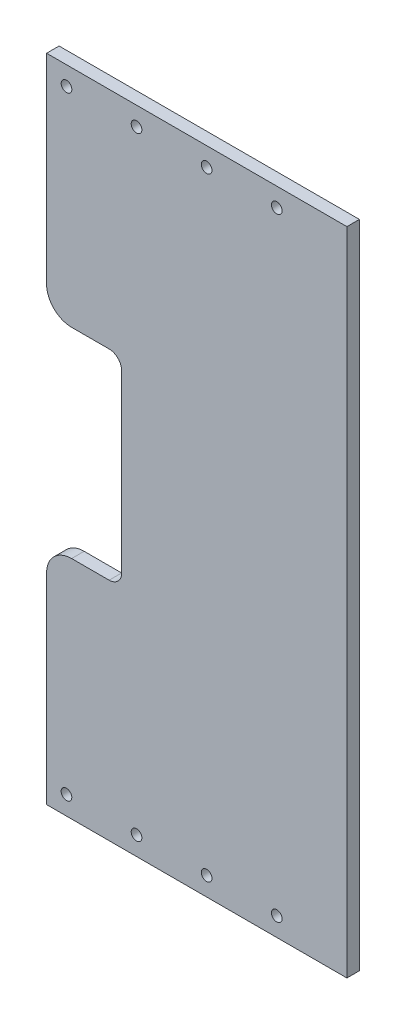
ISO-10303-21;
HEADER;
FILE_DESCRIPTION(('STEP AP214'),'2;1');
FILE_NAME('part.step','',(''),(''),'','','');
FILE_SCHEMA(('AUTOMOTIVE_DESIGN { 1 0 10303 214 1 1 1 1 }'));
ENDSEC;
DATA;
#1=APPLICATION_CONTEXT('core data for automotive mechanical design processes');
#2=APPLICATION_PROTOCOL_DEFINITION('international standard','automotive_design',2000,#1);
#3=PRODUCT_CONTEXT('',#1,'mechanical');
#4=PRODUCT('Part','Part','',(#3));
#5=PRODUCT_RELATED_PRODUCT_CATEGORY('part','',(#4));
#6=PRODUCT_DEFINITION_FORMATION('','',#4);
#7=PRODUCT_DEFINITION_CONTEXT('part definition',#1,'design');
#8=PRODUCT_DEFINITION('design','',#6,#7);
#9=PRODUCT_DEFINITION_SHAPE('','',#8);
#10=(LENGTH_UNIT() NAMED_UNIT(*) SI_UNIT(.MILLI.,.METRE.));
#11=(NAMED_UNIT(*) PLANE_ANGLE_UNIT() SI_UNIT($,.RADIAN.));
#12=(NAMED_UNIT(*) SI_UNIT($,.STERADIAN.) SOLID_ANGLE_UNIT());
#13=UNCERTAINTY_MEASURE_WITH_UNIT(LENGTH_MEASURE(1.E-05),#10,'distance_accuracy_value','');
#14=(GEOMETRIC_REPRESENTATION_CONTEXT(3) GLOBAL_UNCERTAINTY_ASSIGNED_CONTEXT((#13)) GLOBAL_UNIT_ASSIGNED_CONTEXT((#10,
#11,#12)) REPRESENTATION_CONTEXT('',''));
#15=CARTESIAN_POINT('',(0.,0.,0.));
#16=DIRECTION('',(0.,0.,1.));
#17=DIRECTION('',(1.,0.,0.));
#18=AXIS2_PLACEMENT_3D('',#15,#16,#17);
#19=CARTESIAN_POINT('',(-31.7482479630799,-31.6510369494426,3.175));
#20=DIRECTION('',(0.,0.,1.));
#21=DIRECTION('',(1.,0.,0.));
#22=AXIS2_PLACEMENT_3D('',#19,#20,#21);
#23=PLANE('',#22);
#24=CARTESIAN_POINT('',(-15.2749199243039,77.7875000000002,3.175));
#25=DIRECTION('',(0.,0.,1.));
#26=DIRECTION('',(1.,0.,0.));
#27=AXIS2_PLACEMENT_3D('',#24,#25,#26);
#28=CIRCLE('',#27,1.35255075153402);
#29=CARTESIAN_POINT('',(-13.9223691727699,77.7875000000002,3.175));
#30=VERTEX_POINT('',#29);
#31=EDGE_CURVE('E518',#30,#30,#28,.T.);
#32=ORIENTED_EDGE('',*,*,#31,.F.);
#33=EDGE_LOOP('',(#32));
#34=FACE_BOUND('',#33,.T.);
#35=CARTESIAN_POINT('',(20.2981426532958,77.7875000000002,3.175));
#36=DIRECTION('',(0.,0.,1.));
#37=DIRECTION('',(0.,-1.,0.));
#38=AXIS2_PLACEMENT_3D('',#35,#36,#37);
#39=ELLIPSE('',#38,1.35255000000001,1.35254924846639);
#40=CARTESIAN_POINT('',(20.2981426532958,76.4349500000001,3.175));
#41=VERTEX_POINT('',#40);
#42=EDGE_CURVE('E530',#41,#41,#39,.T.);
#43=ORIENTED_EDGE('',*,*,#42,.F.);
#44=EDGE_LOOP('',(#43));
#45=FACE_BOUND('',#44,.T.);
#46=CARTESIAN_POINT('',(-15.2747482365244,-77.7874999999998,3.175));
#47=DIRECTION('',(0.,0.,1.));
#48=DIRECTION('',(1.,0.,0.));
#49=AXIS2_PLACEMENT_3D('',#46,#47,#48);
#50=CIRCLE('',#49,1.35255075153402);
#51=CARTESIAN_POINT('',(-13.9221974849904,-77.7874999999998,3.175));
#52=VERTEX_POINT('',#51);
#53=EDGE_CURVE('E543',#52,#52,#50,.T.);
#54=ORIENTED_EDGE('',*,*,#53,.F.);
#55=EDGE_LOOP('',(#54));
#56=FACE_BOUND('',#55,.T.);
#57=CARTESIAN_POINT('',(20.2983143410756,-77.7874999999998,3.175));
#58=DIRECTION('',(0.,0.,1.));
#59=DIRECTION('',(0.,-1.,0.));
#60=AXIS2_PLACEMENT_3D('',#57,#58,#59);
#61=ELLIPSE('',#60,1.35255000000001,1.35254924846639);
#62=CARTESIAN_POINT('',(20.2983143410756,-79.1400499999998,3.175));
#63=VERTEX_POINT('',#62);
#64=EDGE_CURVE('E166',#63,#63,#61,.T.);
#65=ORIENTED_EDGE('',*,*,#64,.F.);
#66=EDGE_LOOP('',(#65));
#67=FACE_BOUND('',#66,.T.);
#68=DIRECTION('',(-1.,0.,0.));
#69=VECTOR('',#68,1.);
#70=CARTESIAN_POINT('',(-38.0982444347531,82.5499999999999,3.175));
#71=LINE('',#70,#69);
#72=CARTESIAN_POINT('',(38.0982444347532,82.5499999999999,3.175));
#73=VERTEX_POINT('',#72);
#74=CARTESIAN_POINT('',(-38.0982444347531,82.5499999999999,3.175));
#75=VERTEX_POINT('',#74);
#76=EDGE_CURVE('E185',#73,#75,#71,.T.);
#77=ORIENTED_EDGE('',*,*,#76,.T.);
#78=DIRECTION('',(0.,-1.,0.));
#79=VECTOR('',#78,1.);
#80=CARTESIAN_POINT('',(-38.0982444347531,82.5499999999999,3.175));
#81=LINE('',#80,#79);
#82=CARTESIAN_POINT('',(-38.0982444347531,31.8489630505574,3.175));
#83=VERTEX_POINT('',#82);
#84=EDGE_CURVE('E113',#75,#83,#81,.T.);
#85=ORIENTED_EDGE('',*,*,#84,.T.);
#86=CARTESIAN_POINT('',(-31.7482479630799,31.8489630505574,3.175));
#87=DIRECTION('',(0.,0.,1.));
#88=DIRECTION('',(-5.03665350895893E-11,-1.,0.));
#89=AXIS2_PLACEMENT_3D('',#86,#87,#88);
#90=ELLIPSE('',#89,6.34999999999999,6.3499964716732);
#91=CARTESIAN_POINT('',(-31.7482479630799,25.4989630505574,3.175));
#92=VERTEX_POINT('',#91);
#93=EDGE_CURVE('E212',#83,#92,#90,.T.);
#94=ORIENTED_EDGE('',*,*,#93,.T.);
#95=DIRECTION('',(1.,0.,0.));
#96=VECTOR('',#95,1.);
#97=CARTESIAN_POINT('',(-31.7482479630799,25.4989630505574,3.175));
#98=LINE('',#97,#96);
#99=CARTESIAN_POINT('',(-22.2232532555701,25.4989630505574,3.175));
#100=VERTEX_POINT('',#99);
#101=EDGE_CURVE('E231',#92,#100,#98,.T.);
#102=ORIENTED_EDGE('',*,*,#101,.T.);
#103=CARTESIAN_POINT('',(-22.2232532555701,22.3239630505574,3.175));
#104=DIRECTION('',(0.,0.,-1.));
#105=DIRECTION('',(5.03665350895893E-11,1.,0.));
#106=AXIS2_PLACEMENT_3D('',#103,#104,#105);
#107=ELLIPSE('',#106,3.175,3.1749982358366);
#108=CARTESIAN_POINT('',(-19.0482550197335,22.3239630505574,3.175));
#109=VERTEX_POINT('',#108);
#110=EDGE_CURVE('E228',#100,#109,#107,.T.);
#111=ORIENTED_EDGE('',*,*,#110,.T.);
#112=DIRECTION('',(0.,-1.,0.));
#113=VECTOR('',#112,1.);
#114=CARTESIAN_POINT('',(-19.0482550197335,22.3239630505574,3.175));
#115=LINE('',#114,#113);
#116=CARTESIAN_POINT('',(-19.0482550197335,-22.1260369494426,3.175));
#117=VERTEX_POINT('',#116);
#118=EDGE_CURVE('E230',#109,#117,#115,.T.);
#119=ORIENTED_EDGE('',*,*,#118,.T.);
#120=CARTESIAN_POINT('',(-22.2232532555701,-22.1260369494426,3.175));
#121=DIRECTION('',(0.,0.,-1.));
#122=DIRECTION('',(5.03665350895893E-11,1.,0.));
#123=AXIS2_PLACEMENT_3D('',#120,#121,#122);
#124=ELLIPSE('',#123,3.175,3.1749982358366);
#125=CARTESIAN_POINT('',(-22.2232532555701,-25.3010369494426,3.175));
#126=VERTEX_POINT('',#125);
#127=EDGE_CURVE('E233',#117,#126,#124,.T.);
#128=ORIENTED_EDGE('',*,*,#127,.T.);
#129=DIRECTION('',(-1.,0.,0.));
#130=VECTOR('',#129,1.);
#131=CARTESIAN_POINT('',(-22.2232532555701,-25.3010369494426,3.175));
#132=LINE('',#131,#130);
#133=CARTESIAN_POINT('',(-31.7482479630799,-25.3010369494426,3.175));
#134=VERTEX_POINT('',#133);
#135=EDGE_CURVE('E289',#126,#134,#132,.T.);
#136=ORIENTED_EDGE('',*,*,#135,.T.);
#137=CARTESIAN_POINT('',(-31.7482479630799,-31.6510369494426,3.175));
#138=DIRECTION('',(0.,0.,1.));
#139=DIRECTION('',(-5.03665350895893E-11,-1.,0.));
#140=AXIS2_PLACEMENT_3D('',#137,#138,#139);
#141=ELLIPSE('',#140,6.35,6.34999647167321);
#142=CARTESIAN_POINT('',(-38.0982444347531,-31.6510369494426,3.175));
#143=VERTEX_POINT('',#142);
#144=EDGE_CURVE('E144',#134,#143,#141,.T.);
#145=ORIENTED_EDGE('',*,*,#144,.T.);
#146=DIRECTION('',(0.,-1.,0.));
#147=VECTOR('',#146,1.);
#148=CARTESIAN_POINT('',(-38.0982444347531,-82.5500000000001,3.175));
#149=LINE('',#148,#147);
#150=CARTESIAN_POINT('',(-38.0982444347531,-82.5500000000001,3.175));
#151=VERTEX_POINT('',#150);
#152=EDGE_CURVE('E138',#143,#151,#149,.T.);
#153=ORIENTED_EDGE('',*,*,#152,.T.);
#154=DIRECTION('',(1.,0.,0.));
#155=VECTOR('',#154,1.);
#156=CARTESIAN_POINT('',(-38.0982444347531,-82.5500000000001,3.175));
#157=LINE('',#156,#155);
#158=CARTESIAN_POINT('',(38.0984161225328,-82.5500000000001,3.175));
#159=VERTEX_POINT('',#158);
#160=EDGE_CURVE('E142',#151,#159,#157,.T.);
#161=ORIENTED_EDGE('',*,*,#160,.T.);
#162=DIRECTION('',(-1.03990175445015E-06,0.999999999999459,0.));
#163=VECTOR('',#162,1.);
#164=CARTESIAN_POINT('',(38.0982444347532,82.5499999999999,3.175));
#165=LINE('',#164,#163);
#166=EDGE_CURVE('E58',#159,#73,#165,.T.);
#167=ORIENTED_EDGE('',*,*,#166,.T.);
#168=EDGE_LOOP('',(#77,#85,#94,#102,#111,#119,#128,#136,#145,#153,#161,#167));
#169=FACE_BOUND('',#168,.T.);
#170=CARTESIAN_POINT('',(2.50526164279612,-77.7874999999998,3.175));
#171=DIRECTION('',(0.,0.,1.));
#172=DIRECTION('',(1.,0.,0.));
#173=AXIS2_PLACEMENT_3D('',#170,#171,#172);
#174=CIRCLE('',#173,1.35255075153402);
#175=CARTESIAN_POINT('',(3.85781239433015,-77.7874999999998,3.175));
#176=VERTEX_POINT('',#175);
#177=EDGE_CURVE('E256',#176,#176,#174,.T.);
#178=ORIENTED_EDGE('',*,*,#177,.F.);
#179=EDGE_LOOP('',(#178));
#180=FACE_BOUND('',#179,.T.);
#181=CARTESIAN_POINT('',(-33.0547581158449,-77.7874999999998,3.175));
#182=DIRECTION('',(0.,0.,1.));
#183=DIRECTION('',(1.,0.,0.));
#184=AXIS2_PLACEMENT_3D('',#181,#182,#183);
#185=CIRCLE('',#184,1.35255075153402);
#186=CARTESIAN_POINT('',(-31.7022073643109,-77.7874999999998,3.175));
#187=VERTEX_POINT('',#186);
#188=EDGE_CURVE('E537',#187,#187,#185,.T.);
#189=ORIENTED_EDGE('',*,*,#188,.F.);
#190=EDGE_LOOP('',(#189));
#191=FACE_BOUND('',#190,.T.);
#192=CARTESIAN_POINT('',(2.5050899550166,77.7875000000002,3.175));
#193=DIRECTION('',(0.,0.,1.));
#194=DIRECTION('',(1.,0.,0.));
#195=AXIS2_PLACEMENT_3D('',#192,#193,#194);
#196=CIRCLE('',#195,1.35255075153402);
#197=CARTESIAN_POINT('',(3.85764070655063,77.7875000000002,3.175));
#198=VERTEX_POINT('',#197);
#199=EDGE_CURVE('E524',#198,#198,#196,.T.);
#200=ORIENTED_EDGE('',*,*,#199,.F.);
#201=EDGE_LOOP('',(#200));
#202=FACE_BOUND('',#201,.T.);
#203=CARTESIAN_POINT('',(-33.0418277087591,77.7875000000002,3.175));
#204=DIRECTION('',(0.,0.,1.));
#205=DIRECTION('',(0.,-1.,0.));
#206=AXIS2_PLACEMENT_3D('',#203,#204,#205);
#207=ELLIPSE('',#206,1.35255000000001,1.35254924846639);
#208=CARTESIAN_POINT('',(-33.0418277087591,76.4349500000001,3.175));
#209=VERTEX_POINT('',#208);
#210=EDGE_CURVE('E511',#209,#209,#207,.T.);
#211=ORIENTED_EDGE('',*,*,#210,.F.);
#212=EDGE_LOOP('',(#211));
#213=FACE_BOUND('',#212,.T.);
#214=ADVANCED_FACE('F41',(#34,#45,#56,#67,#169,#180,#191,#202,#213),#23,.T.);
#215=CARTESIAN_POINT('',(-31.7482479630799,-31.6510369494426,0.));
#216=DIRECTION('',(0.,0.,1.));
#217=DIRECTION('',(1.,0.,0.));
#218=AXIS2_PLACEMENT_3D('',#215,#216,#217);
#219=PLANE('',#218);
#220=DIRECTION('',(-1.,0.,0.));
#221=VECTOR('',#220,1.);
#222=CARTESIAN_POINT('',(-38.0982444347531,82.5499999999999,0.));
#223=LINE('',#222,#221);
#224=CARTESIAN_POINT('',(38.0982444347532,82.5499999999999,0.));
#225=VERTEX_POINT('',#224);
#226=CARTESIAN_POINT('',(-38.0982444347531,82.5499999999999,0.));
#227=VERTEX_POINT('',#226);
#228=EDGE_CURVE('E162',#225,#227,#223,.T.);
#229=ORIENTED_EDGE('',*,*,#228,.F.);
#230=DIRECTION('',(-1.03990175445015E-06,0.999999999999459,0.));
#231=VECTOR('',#230,1.);
#232=CARTESIAN_POINT('',(38.0982444347532,82.5499999999999,0.));
#233=LINE('',#232,#231);
#234=CARTESIAN_POINT('',(38.0984161225328,-82.5500000000001,0.));
#235=VERTEX_POINT('',#234);
#236=EDGE_CURVE('E105',#235,#225,#233,.T.);
#237=ORIENTED_EDGE('',*,*,#236,.F.);
#238=DIRECTION('',(1.,0.,0.));
#239=VECTOR('',#238,1.);
#240=CARTESIAN_POINT('',(-38.0982444347531,-82.5500000000001,0.));
#241=LINE('',#240,#239);
#242=CARTESIAN_POINT('',(-38.0982444347531,-82.5500000000001,0.));
#243=VERTEX_POINT('',#242);
#244=EDGE_CURVE('E99',#243,#235,#241,.T.);
#245=ORIENTED_EDGE('',*,*,#244,.F.);
#246=DIRECTION('',(0.,-1.,0.));
#247=VECTOR('',#246,1.);
#248=CARTESIAN_POINT('',(-38.0982444347531,-82.5500000000001,0.));
#249=LINE('',#248,#247);
#250=CARTESIAN_POINT('',(-38.0982444347531,-31.6510369494426,0.));
#251=VERTEX_POINT('',#250);
#252=EDGE_CURVE('E152',#251,#243,#249,.T.);
#253=ORIENTED_EDGE('',*,*,#252,.F.);
#254=CARTESIAN_POINT('',(-31.7482479630799,-31.6510369494426,0.));
#255=DIRECTION('',(0.,0.,1.));
#256=DIRECTION('',(-5.03665350895893E-11,-1.,0.));
#257=AXIS2_PLACEMENT_3D('',#254,#255,#256);
#258=ELLIPSE('',#257,6.35,6.34999647167321);
#259=CARTESIAN_POINT('',(-31.7482479630799,-25.3010369494426,0.));
#260=VERTEX_POINT('',#259);
#261=EDGE_CURVE('E180',#260,#251,#258,.T.);
#262=ORIENTED_EDGE('',*,*,#261,.F.);
#263=DIRECTION('',(-1.,0.,0.));
#264=VECTOR('',#263,1.);
#265=CARTESIAN_POINT('',(-22.2232532555701,-25.3010369494426,0.));
#266=LINE('',#265,#264);
#267=CARTESIAN_POINT('',(-22.2232532555701,-25.3010369494426,0.));
#268=VERTEX_POINT('',#267);
#269=EDGE_CURVE('E178',#268,#260,#266,.T.);
#270=ORIENTED_EDGE('',*,*,#269,.F.);
#271=CARTESIAN_POINT('',(-22.2232532555701,-22.1260369494426,0.));
#272=DIRECTION('',(0.,0.,-1.));
#273=DIRECTION('',(5.03665350895893E-11,1.,0.));
#274=AXIS2_PLACEMENT_3D('',#271,#272,#273);
#275=ELLIPSE('',#274,3.175,3.1749982358366);
#276=CARTESIAN_POINT('',(-19.0482550197335,-22.1260369494426,0.));
#277=VERTEX_POINT('',#276);
#278=EDGE_CURVE('E176',#277,#268,#275,.T.);
#279=ORIENTED_EDGE('',*,*,#278,.F.);
#280=DIRECTION('',(0.,-1.,0.));
#281=VECTOR('',#280,1.);
#282=CARTESIAN_POINT('',(-19.0482550197335,22.3239630505574,0.));
#283=LINE('',#282,#281);
#284=CARTESIAN_POINT('',(-19.0482550197335,22.3239630505574,0.));
#285=VERTEX_POINT('',#284);
#286=EDGE_CURVE('E174',#285,#277,#283,.T.);
#287=ORIENTED_EDGE('',*,*,#286,.F.);
#288=CARTESIAN_POINT('',(-22.2232532555701,22.3239630505574,0.));
#289=DIRECTION('',(0.,0.,-1.));
#290=DIRECTION('',(5.03665350895893E-11,1.,0.));
#291=AXIS2_PLACEMENT_3D('',#288,#289,#290);
#292=ELLIPSE('',#291,3.175,3.1749982358366);
#293=CARTESIAN_POINT('',(-22.2232532555701,25.4989630505574,0.));
#294=VERTEX_POINT('',#293);
#295=EDGE_CURVE('E172',#294,#285,#292,.T.);
#296=ORIENTED_EDGE('',*,*,#295,.F.);
#297=DIRECTION('',(1.,0.,0.));
#298=VECTOR('',#297,1.);
#299=CARTESIAN_POINT('',(-31.7482479630799,25.4989630505574,0.));
#300=LINE('',#299,#298);
#301=CARTESIAN_POINT('',(-31.7482479630799,25.4989630505574,0.));
#302=VERTEX_POINT('',#301);
#303=EDGE_CURVE('E170',#302,#294,#300,.T.);
#304=ORIENTED_EDGE('',*,*,#303,.F.);
#305=CARTESIAN_POINT('',(-31.7482479630799,31.8489630505574,0.));
#306=DIRECTION('',(0.,0.,1.));
#307=DIRECTION('',(-5.03665350895893E-11,-1.,0.));
#308=AXIS2_PLACEMENT_3D('',#305,#306,#307);
#309=ELLIPSE('',#308,6.34999999999999,6.3499964716732);
#310=CARTESIAN_POINT('',(-38.0982444347531,31.8489630505574,0.));
#311=VERTEX_POINT('',#310);
#312=EDGE_CURVE('E168',#311,#302,#309,.T.);
#313=ORIENTED_EDGE('',*,*,#312,.F.);
#314=DIRECTION('',(0.,-1.,0.));
#315=VECTOR('',#314,1.);
#316=CARTESIAN_POINT('',(-38.0982444347531,82.5499999999999,0.));
#317=LINE('',#316,#315);
#318=EDGE_CURVE('E165',#227,#311,#317,.T.);
#319=ORIENTED_EDGE('',*,*,#318,.F.);
#320=EDGE_LOOP('',(#229,#237,#245,#253,#262,#270,#279,#287,#296,#304,#313,#319));
#321=FACE_BOUND('',#320,.T.);
#322=CARTESIAN_POINT('',(20.2983143410756,-77.7874999999998,0.));
#323=DIRECTION('',(0.,0.,1.));
#324=DIRECTION('',(0.,-1.,0.));
#325=AXIS2_PLACEMENT_3D('',#322,#323,#324);
#326=ELLIPSE('',#325,1.35255000000001,1.35254924846639);
#327=CARTESIAN_POINT('',(20.2983143410756,-79.1400499999998,0.));
#328=VERTEX_POINT('',#327);
#329=EDGE_CURVE('E253',#328,#328,#326,.T.);
#330=ORIENTED_EDGE('',*,*,#329,.T.);
#331=EDGE_LOOP('',(#330));
#332=FACE_BOUND('',#331,.T.);
#333=CARTESIAN_POINT('',(2.50526164279612,-77.7874999999998,0.));
#334=DIRECTION('',(0.,0.,1.));
#335=DIRECTION('',(1.,0.,0.));
#336=AXIS2_PLACEMENT_3D('',#333,#334,#335);
#337=CIRCLE('',#336,1.35255075153402);
#338=CARTESIAN_POINT('',(3.85781239433015,-77.7874999999998,0.));
#339=VERTEX_POINT('',#338);
#340=EDGE_CURVE('E260',#339,#339,#337,.T.);
#341=ORIENTED_EDGE('',*,*,#340,.T.);
#342=EDGE_LOOP('',(#341));
#343=FACE_BOUND('',#342,.T.);
#344=CARTESIAN_POINT('',(-15.2747482365244,-77.7874999999998,0.));
#345=DIRECTION('',(0.,0.,1.));
#346=DIRECTION('',(1.,0.,0.));
#347=AXIS2_PLACEMENT_3D('',#344,#345,#346);
#348=CIRCLE('',#347,1.35255075153402);
#349=CARTESIAN_POINT('',(-13.9221974849904,-77.7874999999998,0.));
#350=VERTEX_POINT('',#349);
#351=EDGE_CURVE('E540',#350,#350,#348,.T.);
#352=ORIENTED_EDGE('',*,*,#351,.T.);
#353=EDGE_LOOP('',(#352));
#354=FACE_BOUND('',#353,.T.);
#355=CARTESIAN_POINT('',(-33.0547581158449,-77.7874999999998,0.));
#356=DIRECTION('',(0.,0.,1.));
#357=DIRECTION('',(1.,0.,0.));
#358=AXIS2_PLACEMENT_3D('',#355,#356,#357);
#359=CIRCLE('',#358,1.35255075153402);
#360=CARTESIAN_POINT('',(-31.7022073643109,-77.7874999999998,0.));
#361=VERTEX_POINT('',#360);
#362=EDGE_CURVE('E534',#361,#361,#359,.T.);
#363=ORIENTED_EDGE('',*,*,#362,.T.);
#364=EDGE_LOOP('',(#363));
#365=FACE_BOUND('',#364,.T.);
#366=CARTESIAN_POINT('',(20.2981426532958,77.7875000000002,0.));
#367=DIRECTION('',(0.,0.,1.));
#368=DIRECTION('',(0.,-1.,0.));
#369=AXIS2_PLACEMENT_3D('',#366,#367,#368);
#370=ELLIPSE('',#369,1.35255000000001,1.35254924846639);
#371=CARTESIAN_POINT('',(20.2981426532958,76.4349500000001,0.));
#372=VERTEX_POINT('',#371);
#373=EDGE_CURVE('E527',#372,#372,#370,.T.);
#374=ORIENTED_EDGE('',*,*,#373,.T.);
#375=EDGE_LOOP('',(#374));
#376=FACE_BOUND('',#375,.T.);
#377=CARTESIAN_POINT('',(2.5050899550166,77.7875000000002,0.));
#378=DIRECTION('',(0.,0.,1.));
#379=DIRECTION('',(1.,0.,0.));
#380=AXIS2_PLACEMENT_3D('',#377,#378,#379);
#381=CIRCLE('',#380,1.35255075153402);
#382=CARTESIAN_POINT('',(3.85764070655063,77.7875000000002,0.));
#383=VERTEX_POINT('',#382);
#384=EDGE_CURVE('E521',#383,#383,#381,.T.);
#385=ORIENTED_EDGE('',*,*,#384,.T.);
#386=EDGE_LOOP('',(#385));
#387=FACE_BOUND('',#386,.T.);
#388=CARTESIAN_POINT('',(-15.2749199243039,77.7875000000002,0.));
#389=DIRECTION('',(0.,0.,1.));
#390=DIRECTION('',(1.,0.,0.));
#391=AXIS2_PLACEMENT_3D('',#388,#389,#390);
#392=CIRCLE('',#391,1.35255075153402);
#393=CARTESIAN_POINT('',(-13.9223691727699,77.7875000000002,0.));
#394=VERTEX_POINT('',#393);
#395=EDGE_CURVE('E514',#394,#394,#392,.T.);
#396=ORIENTED_EDGE('',*,*,#395,.T.);
#397=EDGE_LOOP('',(#396));
#398=FACE_BOUND('',#397,.T.);
#399=CARTESIAN_POINT('',(-33.0418277087591,77.7875000000002,0.));
#400=DIRECTION('',(0.,0.,1.));
#401=DIRECTION('',(0.,-1.,0.));
#402=AXIS2_PLACEMENT_3D('',#399,#400,#401);
#403=ELLIPSE('',#402,1.35255000000001,1.35254924846639);
#404=CARTESIAN_POINT('',(-33.0418277087591,76.4349500000001,0.));
#405=VERTEX_POINT('',#404);
#406=EDGE_CURVE('E515',#405,#405,#403,.T.);
#407=ORIENTED_EDGE('',*,*,#406,.T.);
#408=EDGE_LOOP('',(#407));
#409=FACE_BOUND('',#408,.T.);
#410=ADVANCED_FACE('F216',(#321,#332,#343,#354,#365,#376,#387,#398,#409),#219,.F.);
#411=CARTESIAN_POINT('',(-38.0982444347531,82.5499999999999,3.175));
#412=DIRECTION('',(0.,-1.,0.));
#413=DIRECTION('',(0.,0.,-1.));
#414=AXIS2_PLACEMENT_3D('',#411,#412,#413);
#415=PLANE('',#414);
#416=ORIENTED_EDGE('',*,*,#228,.T.);
#417=DIRECTION('',(0.,0.,-1.));
#418=VECTOR('',#417,1.);
#419=CARTESIAN_POINT('',(-38.0982444347531,82.5499999999999,3.175));
#420=LINE('',#419,#418);
#421=EDGE_CURVE('E11',#75,#227,#420,.T.);
#422=ORIENTED_EDGE('',*,*,#421,.F.);
#423=ORIENTED_EDGE('',*,*,#76,.F.);
#424=DIRECTION('',(0.,0.,-1.));
#425=VECTOR('',#424,1.);
#426=CARTESIAN_POINT('',(38.0982444347532,82.5499999999999,3.175));
#427=LINE('',#426,#425);
#428=EDGE_CURVE('E158',#73,#225,#427,.T.);
#429=ORIENTED_EDGE('',*,*,#428,.T.);
#430=EDGE_LOOP('',(#416,#422,#423,#429));
#431=FACE_BOUND('',#430,.T.);
#432=ADVANCED_FACE('F43',(#431),#415,.F.);
#433=CARTESIAN_POINT('',(-38.0982444347531,82.5499999999999,3.175));
#434=DIRECTION('',(1.,0.,0.));
#435=DIRECTION('',(0.,0.,-1.));
#436=AXIS2_PLACEMENT_3D('',#433,#434,#435);
#437=PLANE('',#436);
#438=ORIENTED_EDGE('',*,*,#318,.T.);
#439=DIRECTION('',(0.,0.,-1.));
#440=VECTOR('',#439,1.);
#441=CARTESIAN_POINT('',(-38.0982444347531,31.8489630505574,3.175));
#442=LINE('',#441,#440);
#443=EDGE_CURVE('E50',#83,#311,#442,.T.);
#444=ORIENTED_EDGE('',*,*,#443,.F.);
#445=ORIENTED_EDGE('',*,*,#84,.F.);
#446=ORIENTED_EDGE('',*,*,#421,.T.);
#447=EDGE_LOOP('',(#438,#444,#445,#446));
#448=FACE_BOUND('',#447,.T.);
#449=ADVANCED_FACE('F248',(#448),#437,.F.);
#450=DIRECTION('',(0.,0.,-1.));
#451=VECTOR('',#450,1.);
#452=SURFACE_OF_LINEAR_EXTRUSION('',#90,#451);
#453=ORIENTED_EDGE('',*,*,#312,.T.);
#454=DIRECTION('',(0.,0.,-1.));
#455=VECTOR('',#454,1.);
#456=CARTESIAN_POINT('',(-31.7482479630799,25.4989630505574,3.175));
#457=LINE('',#456,#455);
#458=EDGE_CURVE('E204',#92,#302,#457,.T.);
#459=ORIENTED_EDGE('',*,*,#458,.F.);
#460=ORIENTED_EDGE('',*,*,#93,.F.);
#461=ORIENTED_EDGE('',*,*,#443,.T.);
#462=EDGE_LOOP('',(#453,#459,#460,#461));
#463=FACE_BOUND('',#462,.T.);
#464=ADVANCED_FACE('F210',(#463),#452,.F.);
#465=CARTESIAN_POINT('',(-31.7482479630799,25.4989630505574,3.175));
#466=DIRECTION('',(0.,1.,0.));
#467=DIRECTION('',(0.,0.,1.));
#468=AXIS2_PLACEMENT_3D('',#465,#466,#467);
#469=PLANE('',#468);
#470=ORIENTED_EDGE('',*,*,#303,.T.);
#471=DIRECTION('',(0.,0.,-1.));
#472=VECTOR('',#471,1.);
#473=CARTESIAN_POINT('',(-22.2232532555701,25.4989630505574,3.175));
#474=LINE('',#473,#472);
#475=EDGE_CURVE('E201',#100,#294,#474,.T.);
#476=ORIENTED_EDGE('',*,*,#475,.F.);
#477=ORIENTED_EDGE('',*,*,#101,.F.);
#478=ORIENTED_EDGE('',*,*,#458,.T.);
#479=EDGE_LOOP('',(#470,#476,#477,#478));
#480=FACE_BOUND('',#479,.T.);
#481=ADVANCED_FACE('F222',(#480),#469,.F.);
#482=DIRECTION('',(0.,0.,-1.));
#483=VECTOR('',#482,1.);
#484=SURFACE_OF_LINEAR_EXTRUSION('',#107,#483);
#485=ORIENTED_EDGE('',*,*,#295,.T.);
#486=DIRECTION('',(0.,0.,-1.));
#487=VECTOR('',#486,1.);
#488=CARTESIAN_POINT('',(-19.0482550197335,22.3239630505574,3.175));
#489=LINE('',#488,#487);
#490=EDGE_CURVE('E198',#109,#285,#489,.T.);
#491=ORIENTED_EDGE('',*,*,#490,.F.);
#492=ORIENTED_EDGE('',*,*,#110,.F.);
#493=ORIENTED_EDGE('',*,*,#475,.T.);
#494=EDGE_LOOP('',(#485,#491,#492,#493));
#495=FACE_BOUND('',#494,.T.);
#496=ADVANCED_FACE('F226',(#495),#484,.F.);
#497=CARTESIAN_POINT('',(-19.0482550197335,22.3239630505574,3.175));
#498=DIRECTION('',(1.,0.,0.));
#499=DIRECTION('',(0.,0.,-1.));
#500=AXIS2_PLACEMENT_3D('',#497,#498,#499);
#501=PLANE('',#500);
#502=ORIENTED_EDGE('',*,*,#286,.T.);
#503=DIRECTION('',(0.,0.,-1.));
#504=VECTOR('',#503,1.);
#505=CARTESIAN_POINT('',(-19.0482550197335,-22.1260369494426,3.175));
#506=LINE('',#505,#504);
#507=EDGE_CURVE('E195',#117,#277,#506,.T.);
#508=ORIENTED_EDGE('',*,*,#507,.F.);
#509=ORIENTED_EDGE('',*,*,#118,.F.);
#510=ORIENTED_EDGE('',*,*,#490,.T.);
#511=EDGE_LOOP('',(#502,#508,#509,#510));
#512=FACE_BOUND('',#511,.T.);
#513=ADVANCED_FACE('F243',(#512),#501,.F.);
#514=DIRECTION('',(0.,0.,-1.));
#515=VECTOR('',#514,1.);
#516=SURFACE_OF_LINEAR_EXTRUSION('',#124,#515);
#517=ORIENTED_EDGE('',*,*,#278,.T.);
#518=DIRECTION('',(0.,0.,-1.));
#519=VECTOR('',#518,1.);
#520=CARTESIAN_POINT('',(-22.2232532555701,-25.3010369494426,3.175));
#521=LINE('',#520,#519);
#522=EDGE_CURVE('E192',#126,#268,#521,.T.);
#523=ORIENTED_EDGE('',*,*,#522,.F.);
#524=ORIENTED_EDGE('',*,*,#127,.F.);
#525=ORIENTED_EDGE('',*,*,#507,.T.);
#526=EDGE_LOOP('',(#517,#523,#524,#525));
#527=FACE_BOUND('',#526,.T.);
#528=ADVANCED_FACE('F291',(#527),#516,.F.);
#529=CARTESIAN_POINT('',(-22.2232532555701,-25.3010369494426,3.175));
#530=DIRECTION('',(0.,-1.,0.));
#531=DIRECTION('',(0.,0.,-1.));
#532=AXIS2_PLACEMENT_3D('',#529,#530,#531);
#533=PLANE('',#532);
#534=ORIENTED_EDGE('',*,*,#269,.T.);
#535=DIRECTION('',(0.,0.,-1.));
#536=VECTOR('',#535,1.);
#537=CARTESIAN_POINT('',(-31.7482479630799,-25.3010369494426,3.175));
#538=LINE('',#537,#536);
#539=EDGE_CURVE('E189',#134,#260,#538,.T.);
#540=ORIENTED_EDGE('',*,*,#539,.F.);
#541=ORIENTED_EDGE('',*,*,#135,.F.);
#542=ORIENTED_EDGE('',*,*,#522,.T.);
#543=EDGE_LOOP('',(#534,#540,#541,#542));
#544=FACE_BOUND('',#543,.T.);
#545=ADVANCED_FACE('F285',(#544),#533,.F.);
#546=DIRECTION('',(0.,0.,-1.));
#547=VECTOR('',#546,1.);
#548=SURFACE_OF_LINEAR_EXTRUSION('',#141,#547);
#549=ORIENTED_EDGE('',*,*,#261,.T.);
#550=DIRECTION('',(0.,0.,-1.));
#551=VECTOR('',#550,1.);
#552=CARTESIAN_POINT('',(-38.0982444347531,-31.6510369494426,3.175));
#553=LINE('',#552,#551);
#554=EDGE_CURVE('E153',#143,#251,#553,.T.);
#555=ORIENTED_EDGE('',*,*,#554,.F.);
#556=ORIENTED_EDGE('',*,*,#144,.F.);
#557=ORIENTED_EDGE('',*,*,#539,.T.);
#558=EDGE_LOOP('',(#549,#555,#556,#557));
#559=FACE_BOUND('',#558,.T.);
#560=ADVANCED_FACE('F282',(#559),#548,.F.);
#561=CARTESIAN_POINT('',(-38.0982444347531,-82.5500000000001,3.175));
#562=DIRECTION('',(1.,0.,0.));
#563=DIRECTION('',(0.,0.,-1.));
#564=AXIS2_PLACEMENT_3D('',#561,#562,#563);
#565=PLANE('',#564);
#566=ORIENTED_EDGE('',*,*,#252,.T.);
#567=DIRECTION('',(0.,0.,-1.));
#568=VECTOR('',#567,1.);
#569=CARTESIAN_POINT('',(-38.0982444347531,-82.5500000000001,3.175));
#570=LINE('',#569,#568);
#571=EDGE_CURVE('E149',#151,#243,#570,.T.);
#572=ORIENTED_EDGE('',*,*,#571,.F.);
#573=ORIENTED_EDGE('',*,*,#152,.F.);
#574=ORIENTED_EDGE('',*,*,#554,.T.);
#575=EDGE_LOOP('',(#566,#572,#573,#574));
#576=FACE_BOUND('',#575,.T.);
#577=ADVANCED_FACE('F150',(#576),#565,.F.);
#578=CARTESIAN_POINT('',(-38.0982444347531,-82.5500000000001,3.175));
#579=DIRECTION('',(0.,1.,0.));
#580=DIRECTION('',(0.,0.,1.));
#581=AXIS2_PLACEMENT_3D('',#578,#579,#580);
#582=PLANE('',#581);
#583=ORIENTED_EDGE('',*,*,#244,.T.);
#584=DIRECTION('',(0.,0.,-1.));
#585=VECTOR('',#584,1.);
#586=CARTESIAN_POINT('',(38.0984161225328,-82.5500000000001,3.175));
#587=LINE('',#586,#585);
#588=EDGE_CURVE('E154',#159,#235,#587,.T.);
#589=ORIENTED_EDGE('',*,*,#588,.F.);
#590=ORIENTED_EDGE('',*,*,#160,.F.);
#591=ORIENTED_EDGE('',*,*,#571,.T.);
#592=EDGE_LOOP('',(#583,#589,#590,#591));
#593=FACE_BOUND('',#592,.T.);
#594=ADVANCED_FACE('F156',(#593),#582,.F.);
#595=CARTESIAN_POINT('',(38.0982444347532,82.5499999999999,3.175));
#596=DIRECTION('',(-0.999999999999459,-1.03990175445015E-06,0.));
#597=DIRECTION('',(1.03990175445015E-06,-0.999999999999459,0.));
#598=AXIS2_PLACEMENT_3D('',#595,#596,#597);
#599=PLANE('',#598);
#600=ORIENTED_EDGE('',*,*,#236,.T.);
#601=ORIENTED_EDGE('',*,*,#428,.F.);
#602=ORIENTED_EDGE('',*,*,#166,.F.);
#603=ORIENTED_EDGE('',*,*,#588,.T.);
#604=EDGE_LOOP('',(#600,#601,#602,#603));
#605=FACE_BOUND('',#604,.T.);
#606=ADVANCED_FACE('F268',(#605),#599,.F.);
#607=DIRECTION('',(0.,0.,-1.));
#608=VECTOR('',#607,1.);
#609=SURFACE_OF_LINEAR_EXTRUSION('',#61,#608);
#610=ORIENTED_EDGE('',*,*,#64,.T.);
#611=EDGE_LOOP('',(#610));
#612=FACE_BOUND('',#611,.T.);
#613=ORIENTED_EDGE('',*,*,#329,.F.);
#614=EDGE_LOOP('',(#613));
#615=FACE_BOUND('',#614,.T.);
#616=ADVANCED_FACE('F263',(#612,#615),#609,.T.);
#617=CARTESIAN_POINT('',(2.50526164279612,-77.7874999999998,3.175));
#618=DIRECTION('',(0.,0.,-1.));
#619=DIRECTION('',(-1.,0.,0.));
#620=AXIS2_PLACEMENT_3D('',#617,#618,#619);
#621=CYLINDRICAL_SURFACE('',#620,1.35255075153402);
#622=ORIENTED_EDGE('',*,*,#177,.T.);
#623=EDGE_LOOP('',(#622));
#624=FACE_BOUND('',#623,.T.);
#625=ORIENTED_EDGE('',*,*,#340,.F.);
#626=EDGE_LOOP('',(#625));
#627=FACE_BOUND('',#626,.T.);
#628=ADVANCED_FACE('F267',(#624,#627),#621,.F.);
#629=CARTESIAN_POINT('',(-15.2747482365244,-77.7874999999998,3.175));
#630=DIRECTION('',(0.,0.,-1.));
#631=DIRECTION('',(-1.,0.,0.));
#632=AXIS2_PLACEMENT_3D('',#629,#630,#631);
#633=CYLINDRICAL_SURFACE('',#632,1.35255075153402);
#634=ORIENTED_EDGE('',*,*,#53,.T.);
#635=EDGE_LOOP('',(#634));
#636=FACE_BOUND('',#635,.T.);
#637=ORIENTED_EDGE('',*,*,#351,.F.);
#638=EDGE_LOOP('',(#637));
#639=FACE_BOUND('',#638,.T.);
#640=ADVANCED_FACE('F428',(#636,#639),#633,.F.);
#641=CARTESIAN_POINT('',(-33.0547581158449,-77.7874999999998,3.175));
#642=DIRECTION('',(0.,0.,-1.));
#643=DIRECTION('',(-1.,0.,0.));
#644=AXIS2_PLACEMENT_3D('',#641,#642,#643);
#645=CYLINDRICAL_SURFACE('',#644,1.35255075153402);
#646=ORIENTED_EDGE('',*,*,#188,.T.);
#647=EDGE_LOOP('',(#646));
#648=FACE_BOUND('',#647,.T.);
#649=ORIENTED_EDGE('',*,*,#362,.F.);
#650=EDGE_LOOP('',(#649));
#651=FACE_BOUND('',#650,.T.);
#652=ADVANCED_FACE('F438',(#648,#651),#645,.F.);
#653=DIRECTION('',(0.,0.,-1.));
#654=VECTOR('',#653,1.);
#655=SURFACE_OF_LINEAR_EXTRUSION('',#39,#654);
#656=ORIENTED_EDGE('',*,*,#42,.T.);
#657=EDGE_LOOP('',(#656));
#658=FACE_BOUND('',#657,.T.);
#659=ORIENTED_EDGE('',*,*,#373,.F.);
#660=EDGE_LOOP('',(#659));
#661=FACE_BOUND('',#660,.T.);
#662=ADVANCED_FACE('F448',(#658,#661),#655,.T.);
#663=CARTESIAN_POINT('',(2.5050899550166,77.7875000000002,3.175));
#664=DIRECTION('',(0.,0.,-1.));
#665=DIRECTION('',(-1.,0.,0.));
#666=AXIS2_PLACEMENT_3D('',#663,#664,#665);
#667=CYLINDRICAL_SURFACE('',#666,1.35255075153402);
#668=ORIENTED_EDGE('',*,*,#199,.T.);
#669=EDGE_LOOP('',(#668));
#670=FACE_BOUND('',#669,.T.);
#671=ORIENTED_EDGE('',*,*,#384,.F.);
#672=EDGE_LOOP('',(#671));
#673=FACE_BOUND('',#672,.T.);
#674=ADVANCED_FACE('F459',(#670,#673),#667,.F.);
#675=CARTESIAN_POINT('',(-15.2749199243039,77.7875000000002,3.175));
#676=DIRECTION('',(0.,0.,-1.));
#677=DIRECTION('',(-1.,0.,0.));
#678=AXIS2_PLACEMENT_3D('',#675,#676,#677);
#679=CYLINDRICAL_SURFACE('',#678,1.35255075153402);
#680=ORIENTED_EDGE('',*,*,#31,.T.);
#681=EDGE_LOOP('',(#680));
#682=FACE_BOUND('',#681,.T.);
#683=ORIENTED_EDGE('',*,*,#395,.F.);
#684=EDGE_LOOP('',(#683));
#685=FACE_BOUND('',#684,.T.);
#686=ADVANCED_FACE('F470',(#682,#685),#679,.F.);
#687=DIRECTION('',(0.,0.,-1.));
#688=VECTOR('',#687,1.);
#689=SURFACE_OF_LINEAR_EXTRUSION('',#207,#688);
#690=ORIENTED_EDGE('',*,*,#210,.T.);
#691=EDGE_LOOP('',(#690));
#692=FACE_BOUND('',#691,.T.);
#693=ORIENTED_EDGE('',*,*,#406,.F.);
#694=EDGE_LOOP('',(#693));
#695=FACE_BOUND('',#694,.T.);
#696=ADVANCED_FACE('F481',(#692,#695),#689,.T.);
#697=CLOSED_SHELL('',(#214,#410,#432,#449,#464,#481,#496,#513,#528,#545,#560,#577,#594,#606,
#616,#628,#640,#652,#662,#674,#686,#696));
#698=MANIFOLD_SOLID_BREP('B2',#697);
#699=ADVANCED_BREP_SHAPE_REPRESENTATION('',(#18,#698),#14);
#700=SHAPE_DEFINITION_REPRESENTATION(#9,#699);
ENDSEC;
END-ISO-10303-21;
